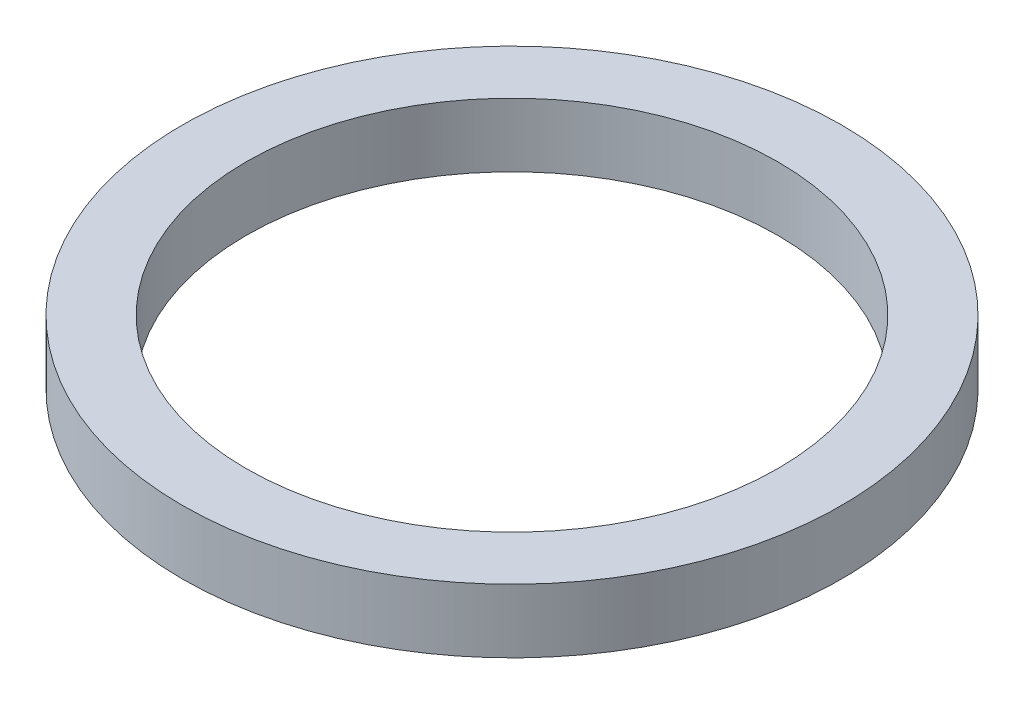
ISO-10303-21;
HEADER;
FILE_DESCRIPTION(('STEP AP214'),'2;1');
FILE_NAME('part.step','',(''),(''),'','','');
FILE_SCHEMA(('AUTOMOTIVE_DESIGN { 1 0 10303 214 1 1 1 1 }'));
ENDSEC;
DATA;
#1=APPLICATION_CONTEXT('core data for automotive mechanical design processes');
#2=APPLICATION_PROTOCOL_DEFINITION('international standard','automotive_design',2000,#1);
#3=PRODUCT_CONTEXT('',#1,'mechanical');
#4=PRODUCT('Part','Part','',(#3));
#5=PRODUCT_RELATED_PRODUCT_CATEGORY('part','',(#4));
#6=PRODUCT_DEFINITION_FORMATION('','',#4);
#7=PRODUCT_DEFINITION_CONTEXT('part definition',#1,'design');
#8=PRODUCT_DEFINITION('design','',#6,#7);
#9=PRODUCT_DEFINITION_SHAPE('','',#8);
#10=(LENGTH_UNIT() NAMED_UNIT(*) SI_UNIT(.MILLI.,.METRE.));
#11=(NAMED_UNIT(*) PLANE_ANGLE_UNIT() SI_UNIT($,.RADIAN.));
#12=(NAMED_UNIT(*) SI_UNIT($,.STERADIAN.) SOLID_ANGLE_UNIT());
#13=UNCERTAINTY_MEASURE_WITH_UNIT(LENGTH_MEASURE(1.E-05),#10,'distance_accuracy_value','');
#14=(GEOMETRIC_REPRESENTATION_CONTEXT(3) GLOBAL_UNCERTAINTY_ASSIGNED_CONTEXT((#13)) GLOBAL_UNIT_ASSIGNED_CONTEXT((#10,
#11,#12)) REPRESENTATION_CONTEXT('',''));
#15=CARTESIAN_POINT('',(0.,0.,0.));
#16=DIRECTION('',(0.,0.,1.));
#17=DIRECTION('',(1.,0.,0.));
#18=AXIS2_PLACEMENT_3D('',#15,#16,#17);
#19=CARTESIAN_POINT('',(33.0000000000001,-42.25,134.));
#20=DIRECTION('',(0.,-1.,0.));
#21=DIRECTION('',(0.,0.,-1.));
#22=AXIS2_PLACEMENT_3D('',#19,#20,#21);
#23=CYLINDRICAL_SURFACE('',#22,15.5);
#24=CARTESIAN_POINT('',(33.0000000000001,-40.75,134.));
#25=DIRECTION('',(0.,-1.,0.));
#26=DIRECTION('',(0.,0.,-1.));
#27=AXIS2_PLACEMENT_3D('',#24,#25,#26);
#28=CIRCLE('',#27,15.5);
#29=CARTESIAN_POINT('',(33.0000000000001,-40.75,118.5));
#30=VERTEX_POINT('',#29);
#31=EDGE_CURVE('E10',#30,#30,#28,.T.);
#32=ORIENTED_EDGE('',*,*,#31,.T.);
#33=EDGE_LOOP('',(#32));
#34=FACE_BOUND('',#33,.T.);
#35=CARTESIAN_POINT('',(33.0000000000001,-43.75,134.));
#36=DIRECTION('',(0.,-1.,0.));
#37=DIRECTION('',(0.,0.,-1.));
#38=AXIS2_PLACEMENT_3D('',#35,#36,#37);
#39=CIRCLE('',#38,15.5);
#40=CARTESIAN_POINT('',(33.0000000000001,-43.75,118.5));
#41=VERTEX_POINT('',#40);
#42=EDGE_CURVE('E27',#41,#41,#39,.T.);
#43=ORIENTED_EDGE('',*,*,#42,.F.);
#44=EDGE_LOOP('',(#43));
#45=FACE_BOUND('',#44,.T.);
#46=ADVANCED_FACE('F14',(#34,#45),#23,.T.);
#47=CARTESIAN_POINT('',(33.0000000000001,-18.75,134.));
#48=DIRECTION('',(0.,-1.,0.));
#49=DIRECTION('',(0.,0.,-1.));
#50=AXIS2_PLACEMENT_3D('',#47,#48,#49);
#51=CYLINDRICAL_SURFACE('',#50,12.5);
#52=CARTESIAN_POINT('',(33.0000000000001,-40.75,134.));
#53=DIRECTION('',(0.,-1.,0.));
#54=DIRECTION('',(0.,0.,-1.));
#55=AXIS2_PLACEMENT_3D('',#52,#53,#54);
#56=CIRCLE('',#55,12.5);
#57=CARTESIAN_POINT('',(33.0000000000001,-40.75,121.5));
#58=VERTEX_POINT('',#57);
#59=EDGE_CURVE('E22',#58,#58,#56,.T.);
#60=ORIENTED_EDGE('',*,*,#59,.F.);
#61=EDGE_LOOP('',(#60));
#62=FACE_BOUND('',#61,.T.);
#63=CARTESIAN_POINT('',(33.0000000000001,-43.75,134.));
#64=DIRECTION('',(0.,1.,0.));
#65=DIRECTION('',(1.,0.,0.));
#66=AXIS2_PLACEMENT_3D('',#63,#64,#65);
#67=CIRCLE('',#66,12.5);
#68=CARTESIAN_POINT('',(45.5000000000001,-43.75,134.));
#69=VERTEX_POINT('',#68);
#70=EDGE_CURVE('E18',#69,#69,#67,.T.);
#71=ORIENTED_EDGE('',*,*,#70,.F.);
#72=EDGE_LOOP('',(#71));
#73=FACE_BOUND('',#72,.T.);
#74=ADVANCED_FACE('F16',(#62,#73),#51,.F.);
#75=CARTESIAN_POINT('',(33.0000000000001,-40.75,134.));
#76=DIRECTION('',(0.,1.,0.));
#77=DIRECTION('',(0.,0.,1.));
#78=AXIS2_PLACEMENT_3D('',#75,#76,#77);
#79=PLANE('',#78);
#80=ORIENTED_EDGE('',*,*,#31,.F.);
#81=EDGE_LOOP('',(#80));
#82=FACE_BOUND('',#81,.T.);
#83=ORIENTED_EDGE('',*,*,#59,.T.);
#84=EDGE_LOOP('',(#83));
#85=FACE_BOUND('',#84,.T.);
#86=ADVANCED_FACE('F38',(#82,#85),#79,.T.);
#87=CARTESIAN_POINT('',(33.0000000000001,-43.75,134.));
#88=DIRECTION('',(0.,-1.,0.));
#89=DIRECTION('',(0.,0.,-1.));
#90=AXIS2_PLACEMENT_3D('',#87,#88,#89);
#91=PLANE('',#90);
#92=ORIENTED_EDGE('',*,*,#42,.T.);
#93=EDGE_LOOP('',(#92));
#94=FACE_BOUND('',#93,.T.);
#95=ORIENTED_EDGE('',*,*,#70,.T.);
#96=EDGE_LOOP('',(#95));
#97=FACE_BOUND('',#96,.T.);
#98=ADVANCED_FACE('F35',(#94,#97),#91,.T.);
#99=CLOSED_SHELL('',(#46,#74,#86,#98));
#100=MANIFOLD_SOLID_BREP('B1',#99);
#101=ADVANCED_BREP_SHAPE_REPRESENTATION('',(#18,#100),#14);
#102=SHAPE_DEFINITION_REPRESENTATION(#9,#101);
ENDSEC;
END-ISO-10303-21;
